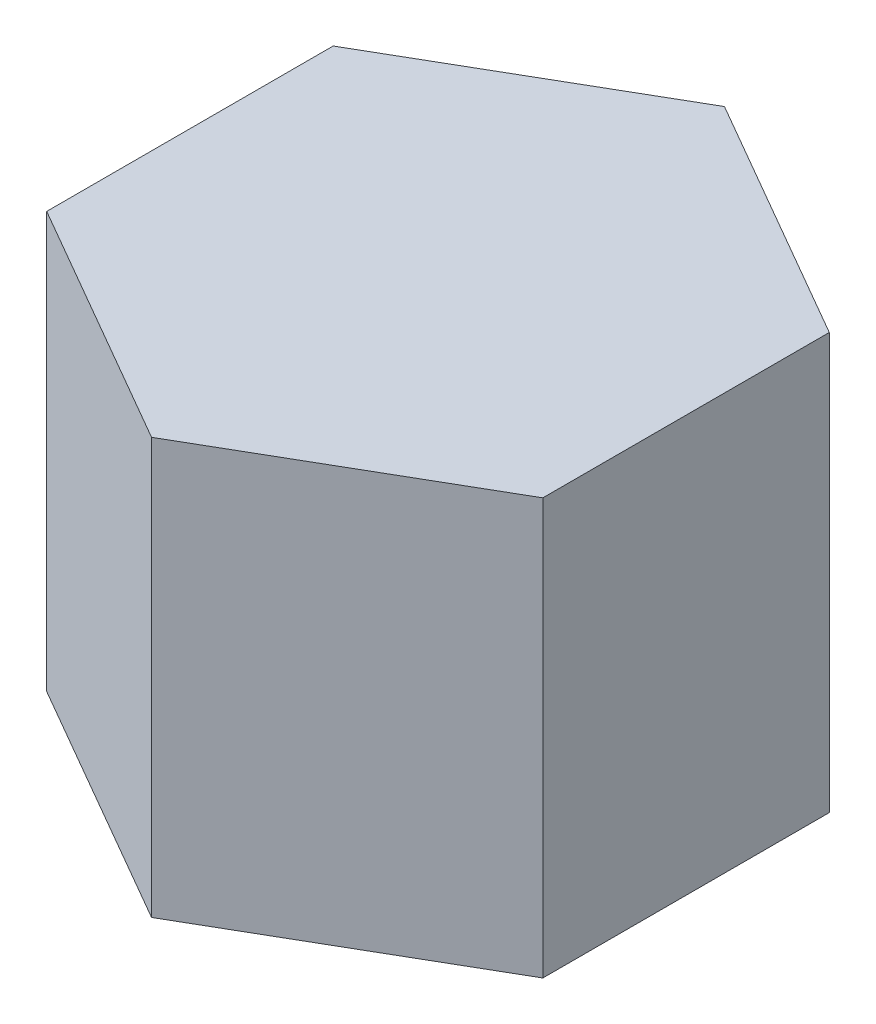
ISO-10303-21;
HEADER;
FILE_DESCRIPTION(('STEP AP214'),'2;1');
FILE_NAME('part.step','',(''),(''),'','','');
FILE_SCHEMA(('AUTOMOTIVE_DESIGN { 1 0 10303 214 1 1 1 1 }'));
ENDSEC;
DATA;
#1=APPLICATION_CONTEXT('core data for automotive mechanical design processes');
#2=APPLICATION_PROTOCOL_DEFINITION('international standard','automotive_design',2000,#1);
#3=PRODUCT_CONTEXT('',#1,'mechanical');
#4=PRODUCT('Part','Part','',(#3));
#5=PRODUCT_RELATED_PRODUCT_CATEGORY('part','',(#4));
#6=PRODUCT_DEFINITION_FORMATION('','',#4);
#7=PRODUCT_DEFINITION_CONTEXT('part definition',#1,'design');
#8=PRODUCT_DEFINITION('design','',#6,#7);
#9=PRODUCT_DEFINITION_SHAPE('','',#8);
#10=(LENGTH_UNIT() NAMED_UNIT(*) SI_UNIT(.MILLI.,.METRE.));
#11=(NAMED_UNIT(*) PLANE_ANGLE_UNIT() SI_UNIT($,.RADIAN.));
#12=(NAMED_UNIT(*) SI_UNIT($,.STERADIAN.) SOLID_ANGLE_UNIT());
#13=UNCERTAINTY_MEASURE_WITH_UNIT(LENGTH_MEASURE(1.E-05),#10,'distance_accuracy_value','');
#14=(GEOMETRIC_REPRESENTATION_CONTEXT(3) GLOBAL_UNCERTAINTY_ASSIGNED_CONTEXT((#13)) GLOBAL_UNIT_ASSIGNED_CONTEXT((#10,
#11,#12)) REPRESENTATION_CONTEXT('',''));
#15=CARTESIAN_POINT('',(0.,0.,0.));
#16=DIRECTION('',(0.,0.,1.));
#17=DIRECTION('',(1.,0.,0.));
#18=AXIS2_PLACEMENT_3D('',#15,#16,#17);
#19=CARTESIAN_POINT('',(203.642660308706,-148.537700895744,294.971072835632));
#20=DIRECTION('',(-0.499999999999943,0.,-0.866025403784472));
#21=DIRECTION('',(-0.866025403784472,0.,0.499999999999943));
#22=AXIS2_PLACEMENT_3D('',#19,#20,#21);
#23=PLANE('',#22);
#24=CARTESIAN_POINT('',(203.339551417381,-149.045793579175,295.146072835632));
#25=DIRECTION('',(0.866025403784471,0.,-0.499999999999943));
#26=VECTOR('',#25,1.);
#27=LINE('',#24,#26);
#28=CARTESIAN_POINT('',(203.339551417382,-149.045793579175,295.146072835632));
#29=VERTEX_POINT('',#28);
#30=CARTESIAN_POINT('',(203.642660308706,-149.045793579175,294.971072835632));
#31=VERTEX_POINT('',#30);
#32=EDGE_CURVE('E170',#29,#31,#27,.T.);
#33=ORIENTED_EDGE('',*,*,#32,.T.);
#34=CARTESIAN_POINT('',(203.642660308706,-148.537700895744,294.971072835632));
#35=DIRECTION('',(0.,-1.,0.));
#36=VECTOR('',#35,1.);
#37=LINE('',#34,#36);
#38=CARTESIAN_POINT('',(203.642660308706,-148.537700895744,294.971072835632));
#39=VERTEX_POINT('',#38);
#40=EDGE_CURVE('E35',#39,#31,#37,.T.);
#41=ORIENTED_EDGE('',*,*,#40,.F.);
#42=CARTESIAN_POINT('',(203.339551417381,-148.537700895744,295.146072835632));
#43=DIRECTION('',(0.866025403784471,0.,-0.499999999999943));
#44=VECTOR('',#43,1.);
#45=LINE('',#42,#44);
#46=CARTESIAN_POINT('',(203.339551417382,-148.537700895744,295.146072835632));
#47=VERTEX_POINT('',#46);
#48=EDGE_CURVE('E159',#47,#39,#45,.T.);
#49=ORIENTED_EDGE('',*,*,#48,.F.);
#50=CARTESIAN_POINT('',(203.339551417381,-148.537700895744,295.146072835632));
#51=DIRECTION('',(0.,-1.,0.));
#52=VECTOR('',#51,1.);
#53=LINE('',#50,#52);
#54=EDGE_CURVE('E10',#47,#29,#53,.T.);
#55=ORIENTED_EDGE('',*,*,#54,.T.);
#56=EDGE_LOOP('',(#33,#41,#49,#55));
#57=FACE_BOUND('',#56,.T.);
#58=ADVANCED_FACE('F16',(#57),#23,.F.);
#59=CARTESIAN_POINT('',(203.339551417382,-148.537700895744,295.146072835632));
#60=DIRECTION('',(0.499999999999978,0.,-0.866025403784452));
#61=DIRECTION('',(-0.866025403784452,0.,-0.499999999999978));
#62=AXIS2_PLACEMENT_3D('',#59,#60,#61);
#63=PLANE('',#62);
#64=CARTESIAN_POINT('',(203.036442526057,-149.045793579175,294.971072835632));
#65=DIRECTION('',(0.866025403784452,0.,0.499999999999978));
#66=VECTOR('',#65,1.);
#67=LINE('',#64,#66);
#68=CARTESIAN_POINT('',(203.036442526057,-149.045793579175,294.971072835632));
#69=VERTEX_POINT('',#68);
#70=EDGE_CURVE('E167',#69,#29,#67,.T.);
#71=ORIENTED_EDGE('',*,*,#70,.T.);
#72=ORIENTED_EDGE('',*,*,#54,.F.);
#73=CARTESIAN_POINT('',(203.036442526057,-148.537700895744,294.971072835632));
#74=DIRECTION('',(0.866025403784452,0.,0.499999999999978));
#75=VECTOR('',#74,1.);
#76=LINE('',#73,#75);
#77=CARTESIAN_POINT('',(203.036442526057,-148.537700895744,294.971072835632));
#78=VERTEX_POINT('',#77);
#79=EDGE_CURVE('E156',#78,#47,#76,.T.);
#80=ORIENTED_EDGE('',*,*,#79,.F.);
#81=CARTESIAN_POINT('',(203.036442526057,-148.537700895744,294.971072835632));
#82=DIRECTION('',(0.,-1.,0.));
#83=VECTOR('',#82,1.);
#84=LINE('',#81,#83);
#85=EDGE_CURVE('E27',#78,#69,#84,.T.);
#86=ORIENTED_EDGE('',*,*,#85,.T.);
#87=EDGE_LOOP('',(#71,#72,#80,#86));
#88=FACE_BOUND('',#87,.T.);
#89=ADVANCED_FACE('F189',(#88),#63,.F.);
#90=CARTESIAN_POINT('',(203.036442526057,-148.537700895744,290.831971220494));
#91=DIRECTION('',(1.,0.,0.));
#92=DIRECTION('',(0.,1.,0.));
#93=AXIS2_PLACEMENT_3D('',#90,#91,#92);
#94=PLANE('',#93);
#95=CARTESIAN_POINT('',(203.036442526057,-149.045793579175,294.621072835632));
#96=DIRECTION('',(0.,0.,1.));
#97=VECTOR('',#96,1.);
#98=LINE('',#95,#97);
#99=CARTESIAN_POINT('',(203.036442526057,-149.045793579175,294.621072835632));
#100=VERTEX_POINT('',#99);
#101=EDGE_CURVE('E163',#100,#69,#98,.T.);
#102=ORIENTED_EDGE('',*,*,#101,.T.);
#103=ORIENTED_EDGE('',*,*,#85,.F.);
#104=CARTESIAN_POINT('',(203.036442526057,-148.537700895744,294.621072835632));
#105=DIRECTION('',(0.,0.,1.));
#106=VECTOR('',#105,1.);
#107=LINE('',#104,#106);
#108=CARTESIAN_POINT('',(203.036442526057,-148.537700895744,294.621072835632));
#109=VERTEX_POINT('',#108);
#110=EDGE_CURVE('E106',#109,#78,#107,.T.);
#111=ORIENTED_EDGE('',*,*,#110,.F.);
#112=CARTESIAN_POINT('',(203.036442526057,-148.537700895744,294.621072835632));
#113=DIRECTION('',(0.,-1.,0.));
#114=VECTOR('',#113,1.);
#115=LINE('',#112,#114);
#116=EDGE_CURVE('E94',#109,#100,#115,.T.);
#117=ORIENTED_EDGE('',*,*,#116,.T.);
#118=EDGE_LOOP('',(#102,#103,#111,#117));
#119=FACE_BOUND('',#118,.T.);
#120=ADVANCED_FACE('F198',(#119),#94,.F.);
#121=CARTESIAN_POINT('',(203.036442526057,-148.537700895744,294.621072835632));
#122=DIRECTION('',(0.499999999999978,0.,0.866025403784452));
#123=DIRECTION('',(0.866025403784452,0.,-0.499999999999978));
#124=AXIS2_PLACEMENT_3D('',#121,#122,#123);
#125=PLANE('',#124);
#126=CARTESIAN_POINT('',(203.339551417382,-149.045793579175,294.446072835632));
#127=DIRECTION('',(-0.866025403784452,0.,0.499999999999978));
#128=VECTOR('',#127,1.);
#129=LINE('',#126,#128);
#130=CARTESIAN_POINT('',(203.339551417382,-149.045793579175,294.446072835632));
#131=VERTEX_POINT('',#130);
#132=EDGE_CURVE('E162',#131,#100,#129,.T.);
#133=ORIENTED_EDGE('',*,*,#132,.T.);
#134=ORIENTED_EDGE('',*,*,#116,.F.);
#135=CARTESIAN_POINT('',(203.339551417382,-148.537700895744,294.446072835632));
#136=DIRECTION('',(-0.866025403784452,0.,0.499999999999978));
#137=VECTOR('',#136,1.);
#138=LINE('',#135,#137);
#139=CARTESIAN_POINT('',(203.339551417382,-148.537700895744,294.446072835632));
#140=VERTEX_POINT('',#139);
#141=EDGE_CURVE('E98',#140,#109,#138,.T.);
#142=ORIENTED_EDGE('',*,*,#141,.F.);
#143=CARTESIAN_POINT('',(203.339551417382,-148.537700895744,294.446072835632));
#144=DIRECTION('',(0.,-1.,0.));
#145=VECTOR('',#144,1.);
#146=LINE('',#143,#145);
#147=EDGE_CURVE('E79',#140,#131,#146,.T.);
#148=ORIENTED_EDGE('',*,*,#147,.T.);
#149=EDGE_LOOP('',(#133,#134,#142,#148));
#150=FACE_BOUND('',#149,.T.);
#151=ADVANCED_FACE('F100',(#150),#125,.F.);
#152=CARTESIAN_POINT('',(203.339551417382,-148.537700895744,294.446072835632));
#153=DIRECTION('',(-0.500000000000096,0.,0.866025403784383));
#154=DIRECTION('',(0.866025403784383,0.,0.500000000000096));
#155=AXIS2_PLACEMENT_3D('',#152,#153,#154);
#156=PLANE('',#155);
#157=CARTESIAN_POINT('',(203.642660308706,-149.045793579175,294.621072835632));
#158=DIRECTION('',(-0.866025403784383,0.,-0.500000000000096));
#159=VECTOR('',#158,1.);
#160=LINE('',#157,#159);
#161=CARTESIAN_POINT('',(203.642660308706,-149.045793579175,294.621072835632));
#162=VERTEX_POINT('',#161);
#163=EDGE_CURVE('E88',#162,#131,#160,.T.);
#164=ORIENTED_EDGE('',*,*,#163,.T.);
#165=ORIENTED_EDGE('',*,*,#147,.F.);
#166=CARTESIAN_POINT('',(203.642660308706,-148.537700895744,294.621072835632));
#167=DIRECTION('',(-0.866025403784383,0.,-0.500000000000096));
#168=VECTOR('',#167,1.);
#169=LINE('',#166,#168);
#170=CARTESIAN_POINT('',(203.642660308706,-148.537700895744,294.621072835632));
#171=VERTEX_POINT('',#170);
#172=EDGE_CURVE('E84',#171,#140,#169,.T.);
#173=ORIENTED_EDGE('',*,*,#172,.F.);
#174=CARTESIAN_POINT('',(203.642660308706,-148.537700895744,294.621072835632));
#175=DIRECTION('',(0.,-1.,0.));
#176=VECTOR('',#175,1.);
#177=LINE('',#174,#176);
#178=EDGE_CURVE('E58',#171,#162,#177,.T.);
#179=ORIENTED_EDGE('',*,*,#178,.T.);
#180=EDGE_LOOP('',(#164,#165,#173,#179));
#181=FACE_BOUND('',#180,.T.);
#182=ADVANCED_FACE('F82',(#181),#156,.F.);
#183=CARTESIAN_POINT('',(203.642660308706,-148.537700895744,290.831971220494));
#184=DIRECTION('',(-1.,0.,0.));
#185=DIRECTION('',(0.,-1.,0.));
#186=AXIS2_PLACEMENT_3D('',#183,#184,#185);
#187=PLANE('',#186);
#188=CARTESIAN_POINT('',(203.642660308706,-149.045793579175,294.971072835632));
#189=DIRECTION('',(0.,0.,-1.));
#190=VECTOR('',#189,1.);
#191=LINE('',#188,#190);
#192=EDGE_CURVE('E160',#31,#162,#191,.T.);
#193=ORIENTED_EDGE('',*,*,#192,.T.);
#194=ORIENTED_EDGE('',*,*,#178,.F.);
#195=CARTESIAN_POINT('',(203.642660308706,-148.537700895744,294.971072835632));
#196=DIRECTION('',(0.,0.,-1.));
#197=VECTOR('',#196,1.);
#198=LINE('',#195,#197);
#199=EDGE_CURVE('E112',#39,#171,#198,.T.);
#200=ORIENTED_EDGE('',*,*,#199,.F.);
#201=ORIENTED_EDGE('',*,*,#40,.T.);
#202=EDGE_LOOP('',(#193,#194,#200,#201));
#203=FACE_BOUND('',#202,.T.);
#204=ADVANCED_FACE('F131',(#203),#187,.F.);
#205=CARTESIAN_POINT('',(206.339551417382,-148.537700895744,290.831971220494));
#206=DIRECTION('',(0.,-1.,0.));
#207=DIRECTION('',(1.,0.,0.));
#208=AXIS2_PLACEMENT_3D('',#205,#206,#207);
#209=PLANE('',#208);
#210=ORIENTED_EDGE('',*,*,#48,.T.);
#211=ORIENTED_EDGE('',*,*,#199,.T.);
#212=ORIENTED_EDGE('',*,*,#172,.T.);
#213=ORIENTED_EDGE('',*,*,#141,.T.);
#214=ORIENTED_EDGE('',*,*,#110,.T.);
#215=ORIENTED_EDGE('',*,*,#79,.T.);
#216=EDGE_LOOP('',(#210,#211,#212,#213,#214,#215));
#217=FACE_BOUND('',#216,.T.);
#218=ADVANCED_FACE('F111',(#217),#209,.F.);
#219=CARTESIAN_POINT('',(206.339551417382,-149.045793579175,290.831971220494));
#220=DIRECTION('',(0.,-1.,0.));
#221=DIRECTION('',(1.,0.,0.));
#222=AXIS2_PLACEMENT_3D('',#219,#220,#221);
#223=PLANE('',#222);
#224=ORIENTED_EDGE('',*,*,#32,.F.);
#225=ORIENTED_EDGE('',*,*,#70,.F.);
#226=ORIENTED_EDGE('',*,*,#101,.F.);
#227=ORIENTED_EDGE('',*,*,#132,.F.);
#228=ORIENTED_EDGE('',*,*,#163,.F.);
#229=ORIENTED_EDGE('',*,*,#192,.F.);
#230=EDGE_LOOP('',(#224,#225,#226,#227,#228,#229));
#231=FACE_BOUND('',#230,.T.);
#232=ADVANCED_FACE('F130',(#231),#223,.T.);
#233=CLOSED_SHELL('',(#58,#89,#120,#151,#182,#204,#218,#232));
#234=MANIFOLD_SOLID_BREP('B1',#233);
#235=ADVANCED_BREP_SHAPE_REPRESENTATION('',(#18,#234),#14);
#236=SHAPE_DEFINITION_REPRESENTATION(#9,#235);
ENDSEC;
END-ISO-10303-21;
